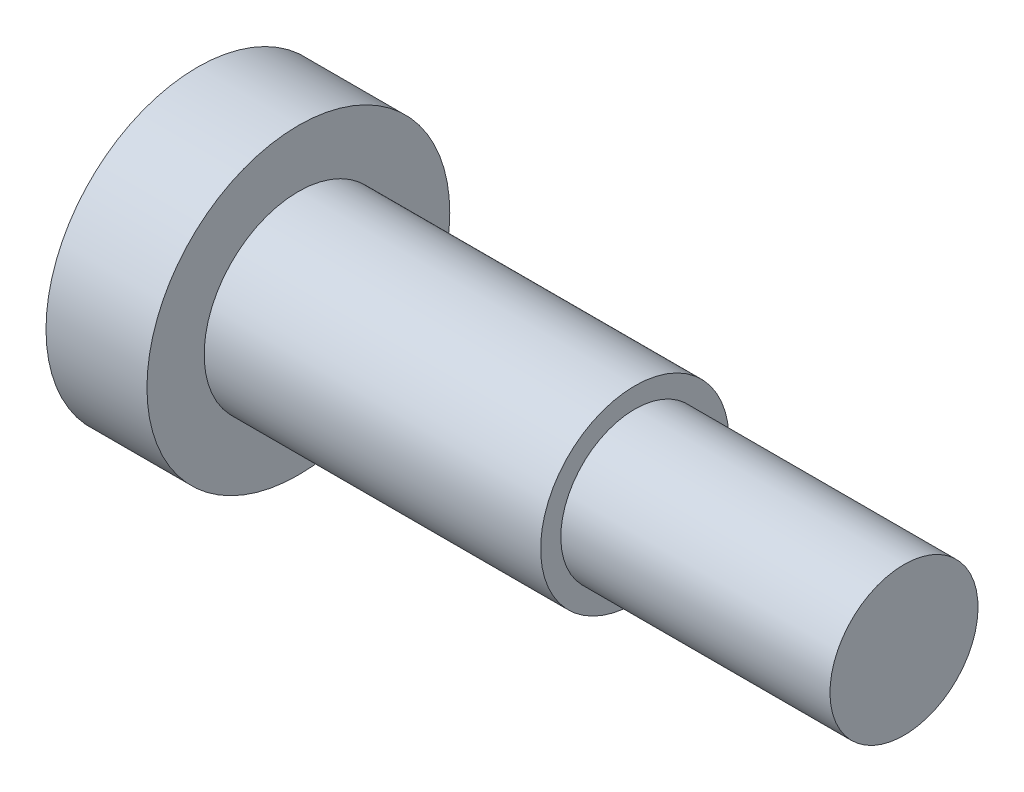
ISO-10303-21;
HEADER;
FILE_DESCRIPTION(('STEP AP214'),'2;1');
FILE_NAME('part.step','',(''),(''),'','','');
FILE_SCHEMA(('AUTOMOTIVE_DESIGN { 1 0 10303 214 1 1 1 1 }'));
ENDSEC;
DATA;
#1=APPLICATION_CONTEXT('core data for automotive mechanical design processes');
#2=APPLICATION_PROTOCOL_DEFINITION('international standard','automotive_design',2000,#1);
#3=PRODUCT_CONTEXT('',#1,'mechanical');
#4=PRODUCT('Part','Part','',(#3));
#5=PRODUCT_RELATED_PRODUCT_CATEGORY('part','',(#4));
#6=PRODUCT_DEFINITION_FORMATION('','',#4);
#7=PRODUCT_DEFINITION_CONTEXT('part definition',#1,'design');
#8=PRODUCT_DEFINITION('design','',#6,#7);
#9=PRODUCT_DEFINITION_SHAPE('','',#8);
#10=(LENGTH_UNIT() NAMED_UNIT(*) SI_UNIT(.MILLI.,.METRE.));
#11=(NAMED_UNIT(*) PLANE_ANGLE_UNIT() SI_UNIT($,.RADIAN.));
#12=(NAMED_UNIT(*) SI_UNIT($,.STERADIAN.) SOLID_ANGLE_UNIT());
#13=UNCERTAINTY_MEASURE_WITH_UNIT(LENGTH_MEASURE(1.E-05),#10,'distance_accuracy_value','');
#14=(GEOMETRIC_REPRESENTATION_CONTEXT(3) GLOBAL_UNCERTAINTY_ASSIGNED_CONTEXT((#13)) GLOBAL_UNIT_ASSIGNED_CONTEXT((#10,
#11,#12)) REPRESENTATION_CONTEXT('',''));
#15=CARTESIAN_POINT('',(0.,0.,0.));
#16=DIRECTION('',(0.,0.,1.));
#17=DIRECTION('',(1.,0.,0.));
#18=AXIS2_PLACEMENT_3D('',#15,#16,#17);
#19=CARTESIAN_POINT('',(0.,0.,0.));
#20=DIRECTION('',(-1.,0.,0.));
#21=DIRECTION('',(0.,-1.,0.));
#22=AXIS2_PLACEMENT_3D('',#19,#20,#21);
#23=PLANE('',#22);
#24=CARTESIAN_POINT('',(0.,0.,0.));
#25=DIRECTION('',(1.,0.,0.));
#26=DIRECTION('',(0.,1.,0.));
#27=AXIS2_PLACEMENT_3D('',#24,#25,#26);
#28=CIRCLE('',#27,22.5);
#29=CARTESIAN_POINT('',(0.,22.5,0.));
#30=VERTEX_POINT('',#29);
#31=EDGE_CURVE('E11',#30,#30,#28,.T.);
#32=ORIENTED_EDGE('',*,*,#31,.F.);
#33=EDGE_LOOP('',(#32));
#34=FACE_BOUND('',#33,.T.);
#35=ADVANCED_FACE('F47',(#34),#23,.T.);
#36=CARTESIAN_POINT('',(105.,0.,0.));
#37=DIRECTION('',(1.,0.,0.));
#38=DIRECTION('',(0.,1.,0.));
#39=AXIS2_PLACEMENT_3D('',#36,#37,#38);
#40=CYLINDRICAL_SURFACE('',#39,22.5);
#41=ORIENTED_EDGE('',*,*,#31,.T.);
#42=EDGE_LOOP('',(#41));
#43=FACE_BOUND('',#42,.T.);
#44=CARTESIAN_POINT('',(15.,0.,0.));
#45=DIRECTION('',(1.,0.,0.));
#46=DIRECTION('',(0.,1.,0.));
#47=AXIS2_PLACEMENT_3D('',#44,#45,#46);
#48=CIRCLE('',#47,22.5);
#49=CARTESIAN_POINT('',(15.,22.5,0.));
#50=VERTEX_POINT('',#49);
#51=EDGE_CURVE('E56',#50,#50,#48,.T.);
#52=ORIENTED_EDGE('',*,*,#51,.F.);
#53=EDGE_LOOP('',(#52));
#54=FACE_BOUND('',#53,.T.);
#55=ADVANCED_FACE('F106',(#43,#54),#40,.T.);
#56=CARTESIAN_POINT('',(15.,22.5,0.));
#57=DIRECTION('',(1.,0.,0.));
#58=DIRECTION('',(0.,1.,0.));
#59=AXIS2_PLACEMENT_3D('',#56,#57,#58);
#60=PLANE('',#59);
#61=ORIENTED_EDGE('',*,*,#51,.T.);
#62=EDGE_LOOP('',(#61));
#63=FACE_BOUND('',#62,.T.);
#64=CARTESIAN_POINT('',(15.,0.,0.));
#65=DIRECTION('',(1.,0.,0.));
#66=DIRECTION('',(0.,1.,0.));
#67=AXIS2_PLACEMENT_3D('',#64,#65,#66);
#68=CIRCLE('',#67,14.);
#69=CARTESIAN_POINT('',(15.,14.,0.));
#70=VERTEX_POINT('',#69);
#71=EDGE_CURVE('E62',#70,#70,#68,.T.);
#72=ORIENTED_EDGE('',*,*,#71,.F.);
#73=EDGE_LOOP('',(#72));
#74=FACE_BOUND('',#73,.T.);
#75=ADVANCED_FACE('F97',(#63,#74),#60,.T.);
#76=CARTESIAN_POINT('',(105.,0.,0.));
#77=DIRECTION('',(1.,0.,0.));
#78=DIRECTION('',(0.,1.,0.));
#79=AXIS2_PLACEMENT_3D('',#76,#77,#78);
#80=CYLINDRICAL_SURFACE('',#79,14.);
#81=ORIENTED_EDGE('',*,*,#71,.T.);
#82=EDGE_LOOP('',(#81));
#83=FACE_BOUND('',#82,.T.);
#84=CARTESIAN_POINT('',(65.,0.,0.));
#85=DIRECTION('',(1.,0.,0.));
#86=DIRECTION('',(0.,1.,0.));
#87=AXIS2_PLACEMENT_3D('',#84,#85,#86);
#88=CIRCLE('',#87,14.);
#89=CARTESIAN_POINT('',(65.,14.,0.));
#90=VERTEX_POINT('',#89);
#91=EDGE_CURVE('E68',#90,#90,#88,.T.);
#92=ORIENTED_EDGE('',*,*,#91,.F.);
#93=EDGE_LOOP('',(#92));
#94=FACE_BOUND('',#93,.T.);
#95=ADVANCED_FACE('F95',(#83,#94),#80,.T.);
#96=CARTESIAN_POINT('',(65.,14.,0.));
#97=DIRECTION('',(1.,0.,0.));
#98=DIRECTION('',(0.,1.,0.));
#99=AXIS2_PLACEMENT_3D('',#96,#97,#98);
#100=PLANE('',#99);
#101=ORIENTED_EDGE('',*,*,#91,.T.);
#102=EDGE_LOOP('',(#101));
#103=FACE_BOUND('',#102,.T.);
#104=CARTESIAN_POINT('',(65.,0.,0.));
#105=DIRECTION('',(1.,0.,0.));
#106=DIRECTION('',(0.,1.,0.));
#107=AXIS2_PLACEMENT_3D('',#104,#105,#106);
#108=CIRCLE('',#107,11.);
#109=CARTESIAN_POINT('',(65.,11.,0.));
#110=VERTEX_POINT('',#109);
#111=EDGE_CURVE('E82',#110,#110,#108,.T.);
#112=ORIENTED_EDGE('',*,*,#111,.F.);
#113=EDGE_LOOP('',(#112));
#114=FACE_BOUND('',#113,.T.);
#115=ADVANCED_FACE('F92',(#103,#114),#100,.T.);
#116=CARTESIAN_POINT('',(105.,0.,0.));
#117=DIRECTION('',(1.,0.,0.));
#118=DIRECTION('',(0.,1.,0.));
#119=AXIS2_PLACEMENT_3D('',#116,#117,#118);
#120=CYLINDRICAL_SURFACE('',#119,11.);
#121=ORIENTED_EDGE('',*,*,#111,.T.);
#122=EDGE_LOOP('',(#121));
#123=FACE_BOUND('',#122,.T.);
#124=CARTESIAN_POINT('',(105.,0.,0.));
#125=DIRECTION('',(1.,0.,0.));
#126=DIRECTION('',(0.,1.,0.));
#127=AXIS2_PLACEMENT_3D('',#124,#125,#126);
#128=CIRCLE('',#127,11.);
#129=CARTESIAN_POINT('',(105.,11.,0.));
#130=VERTEX_POINT('',#129);
#131=EDGE_CURVE('E78',#130,#130,#128,.T.);
#132=ORIENTED_EDGE('',*,*,#131,.F.);
#133=EDGE_LOOP('',(#132));
#134=FACE_BOUND('',#133,.T.);
#135=ADVANCED_FACE('F104',(#123,#134),#120,.T.);
#136=CARTESIAN_POINT('',(105.,11.,0.));
#137=DIRECTION('',(1.,0.,0.));
#138=DIRECTION('',(0.,1.,0.));
#139=AXIS2_PLACEMENT_3D('',#136,#137,#138);
#140=PLANE('',#139);
#141=ORIENTED_EDGE('',*,*,#131,.T.);
#142=EDGE_LOOP('',(#141));
#143=FACE_BOUND('',#142,.T.);
#144=ADVANCED_FACE('F124',(#143),#140,.T.);
#145=CLOSED_SHELL('',(#35,#55,#75,#95,#115,#135,#144));
#146=MANIFOLD_SOLID_BREP('B2',#145);
#147=ADVANCED_BREP_SHAPE_REPRESENTATION('',(#18,#146),#14);
#148=SHAPE_DEFINITION_REPRESENTATION(#9,#147);
ENDSEC;
END-ISO-10303-21;
